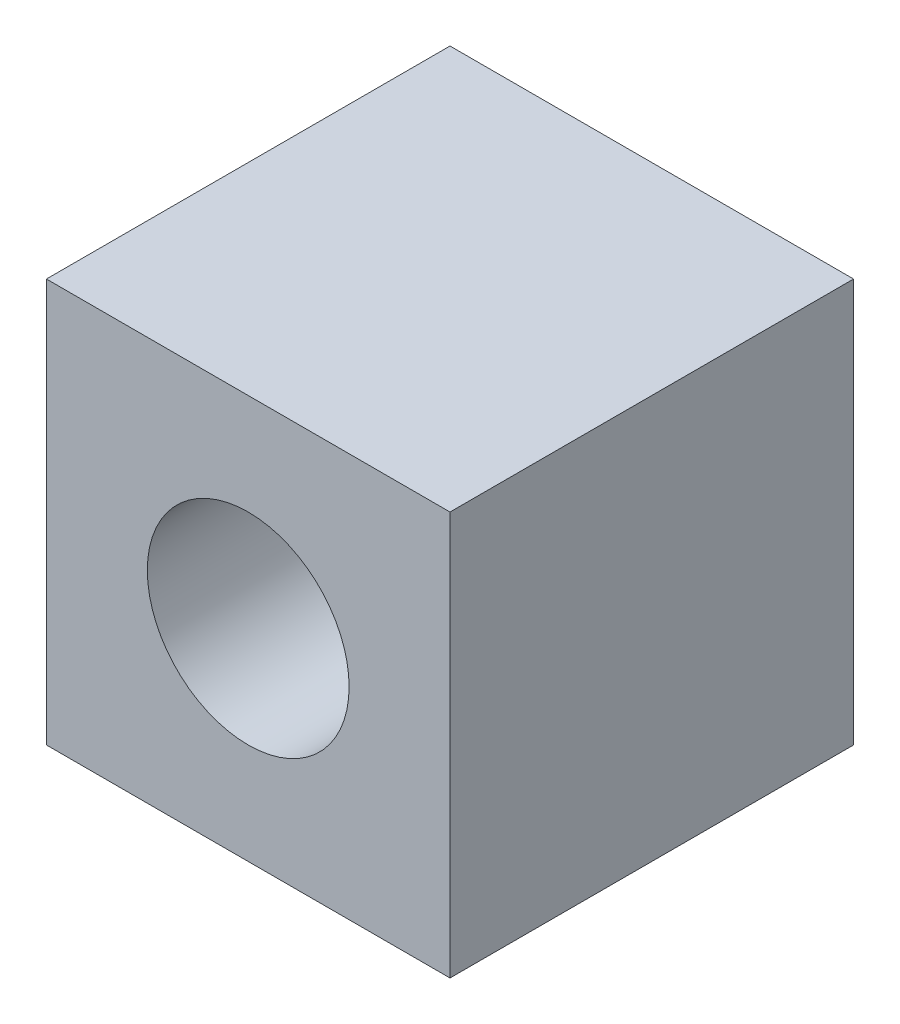
ISO-10303-21;
HEADER;
FILE_DESCRIPTION(('STEP AP214'),'2;1');
FILE_NAME('part.step','',(''),(''),'','','');
FILE_SCHEMA(('AUTOMOTIVE_DESIGN { 1 0 10303 214 1 1 1 1 }'));
ENDSEC;
DATA;
#1=APPLICATION_CONTEXT('core data for automotive mechanical design processes');
#2=APPLICATION_PROTOCOL_DEFINITION('international standard','automotive_design',2000,#1);
#3=PRODUCT_CONTEXT('',#1,'mechanical');
#4=PRODUCT('Part','Part','',(#3));
#5=PRODUCT_RELATED_PRODUCT_CATEGORY('part','',(#4));
#6=PRODUCT_DEFINITION_FORMATION('','',#4);
#7=PRODUCT_DEFINITION_CONTEXT('part definition',#1,'design');
#8=PRODUCT_DEFINITION('design','',#6,#7);
#9=PRODUCT_DEFINITION_SHAPE('','',#8);
#10=(LENGTH_UNIT() NAMED_UNIT(*) SI_UNIT(.MILLI.,.METRE.));
#11=(NAMED_UNIT(*) PLANE_ANGLE_UNIT() SI_UNIT($,.RADIAN.));
#12=(NAMED_UNIT(*) SI_UNIT($,.STERADIAN.) SOLID_ANGLE_UNIT());
#13=UNCERTAINTY_MEASURE_WITH_UNIT(LENGTH_MEASURE(1.E-05),#10,'distance_accuracy_value','');
#14=(GEOMETRIC_REPRESENTATION_CONTEXT(3) GLOBAL_UNCERTAINTY_ASSIGNED_CONTEXT((#13)) GLOBAL_UNIT_ASSIGNED_CONTEXT((#10,
#11,#12)) REPRESENTATION_CONTEXT('',''));
#15=CARTESIAN_POINT('',(0.,0.,0.));
#16=DIRECTION('',(0.,0.,1.));
#17=DIRECTION('',(1.,0.,0.));
#18=AXIS2_PLACEMENT_3D('',#15,#16,#17);
#19=CARTESIAN_POINT('',(0.,0.,10.));
#20=DIRECTION('',(0.,0.,-1.));
#21=DIRECTION('',(-1.,0.,0.));
#22=AXIS2_PLACEMENT_3D('',#19,#20,#21);
#23=PLANE('',#22);
#24=DIRECTION('',(0.,1.,0.));
#25=VECTOR('',#24,1.);
#26=CARTESIAN_POINT('',(5.,-5.,10.));
#27=LINE('',#26,#25);
#28=CARTESIAN_POINT('',(5.,-5.,10.));
#29=VERTEX_POINT('',#28);
#30=CARTESIAN_POINT('',(5.,5.,10.));
#31=VERTEX_POINT('',#30);
#32=EDGE_CURVE('E84',#29,#31,#27,.T.);
#33=ORIENTED_EDGE('',*,*,#32,.T.);
#34=DIRECTION('',(-1.,0.,0.));
#35=VECTOR('',#34,1.);
#36=CARTESIAN_POINT('',(-5.,5.,10.));
#37=LINE('',#36,#35);
#38=CARTESIAN_POINT('',(-5.,5.,10.));
#39=VERTEX_POINT('',#38);
#40=EDGE_CURVE('E79',#31,#39,#37,.T.);
#41=ORIENTED_EDGE('',*,*,#40,.T.);
#42=DIRECTION('',(0.,-1.,0.));
#43=VECTOR('',#42,1.);
#44=CARTESIAN_POINT('',(-5.,-5.,10.));
#45=LINE('',#44,#43);
#46=CARTESIAN_POINT('',(-5.,-5.,10.));
#47=VERTEX_POINT('',#46);
#48=EDGE_CURVE('E82',#39,#47,#45,.T.);
#49=ORIENTED_EDGE('',*,*,#48,.T.);
#50=DIRECTION('',(1.,0.,0.));
#51=VECTOR('',#50,1.);
#52=CARTESIAN_POINT('',(-5.,-5.,10.));
#53=LINE('',#52,#51);
#54=EDGE_CURVE('E49',#47,#29,#53,.T.);
#55=ORIENTED_EDGE('',*,*,#54,.T.);
#56=EDGE_LOOP('',(#33,#41,#49,#55));
#57=FACE_BOUND('',#56,.T.);
#58=CARTESIAN_POINT('',(0.,0.,10.));
#59=DIRECTION('',(0.,0.,1.));
#60=DIRECTION('',(1.,0.,0.));
#61=AXIS2_PLACEMENT_3D('',#58,#59,#60);
#62=CIRCLE('',#61,2.5);
#63=CARTESIAN_POINT('',(2.5,0.,10.));
#64=VERTEX_POINT('',#63);
#65=EDGE_CURVE('E99',#64,#64,#62,.T.);
#66=ORIENTED_EDGE('',*,*,#65,.F.);
#67=EDGE_LOOP('',(#66));
#68=FACE_BOUND('',#67,.T.);
#69=ADVANCED_FACE('F32',(#57,#68),#23,.F.);
#70=CARTESIAN_POINT('',(0.,0.,0.));
#71=DIRECTION('',(0.,0.,-1.));
#72=DIRECTION('',(-1.,0.,0.));
#73=AXIS2_PLACEMENT_3D('',#70,#71,#72);
#74=PLANE('',#73);
#75=DIRECTION('',(0.,1.,0.));
#76=VECTOR('',#75,1.);
#77=CARTESIAN_POINT('',(5.,-5.,0.));
#78=LINE('',#77,#76);
#79=CARTESIAN_POINT('',(5.,-5.,0.));
#80=VERTEX_POINT('',#79);
#81=CARTESIAN_POINT('',(5.,5.,0.));
#82=VERTEX_POINT('',#81);
#83=EDGE_CURVE('E96',#80,#82,#78,.T.);
#84=ORIENTED_EDGE('',*,*,#83,.F.);
#85=DIRECTION('',(1.,0.,0.));
#86=VECTOR('',#85,1.);
#87=CARTESIAN_POINT('',(-5.,-5.,0.));
#88=LINE('',#87,#86);
#89=CARTESIAN_POINT('',(-5.,-5.,0.));
#90=VERTEX_POINT('',#89);
#91=EDGE_CURVE('E72',#90,#80,#88,.T.);
#92=ORIENTED_EDGE('',*,*,#91,.F.);
#93=DIRECTION('',(0.,-1.,0.));
#94=VECTOR('',#93,1.);
#95=CARTESIAN_POINT('',(-5.,-5.,0.));
#96=LINE('',#95,#94);
#97=CARTESIAN_POINT('',(-5.,5.,0.));
#98=VERTEX_POINT('',#97);
#99=EDGE_CURVE('E66',#98,#90,#96,.T.);
#100=ORIENTED_EDGE('',*,*,#99,.F.);
#101=DIRECTION('',(-1.,0.,0.));
#102=VECTOR('',#101,1.);
#103=CARTESIAN_POINT('',(-5.,5.,0.));
#104=LINE('',#103,#102);
#105=EDGE_CURVE('E88',#82,#98,#104,.T.);
#106=ORIENTED_EDGE('',*,*,#105,.F.);
#107=EDGE_LOOP('',(#84,#92,#100,#106));
#108=FACE_BOUND('',#107,.T.);
#109=CARTESIAN_POINT('',(0.,0.,0.));
#110=DIRECTION('',(0.,0.,1.));
#111=DIRECTION('',(1.,0.,0.));
#112=AXIS2_PLACEMENT_3D('',#109,#110,#111);
#113=CIRCLE('',#112,2.5);
#114=CARTESIAN_POINT('',(2.5,0.,0.));
#115=VERTEX_POINT('',#114);
#116=EDGE_CURVE('E111',#115,#115,#113,.T.);
#117=ORIENTED_EDGE('',*,*,#116,.T.);
#118=EDGE_LOOP('',(#117));
#119=FACE_BOUND('',#118,.T.);
#120=ADVANCED_FACE('F107',(#108,#119),#74,.T.);
#121=CARTESIAN_POINT('',(5.,-5.,10.));
#122=DIRECTION('',(-1.,0.,0.));
#123=DIRECTION('',(0.,0.,1.));
#124=AXIS2_PLACEMENT_3D('',#121,#122,#123);
#125=PLANE('',#124);
#126=ORIENTED_EDGE('',*,*,#83,.T.);
#127=DIRECTION('',(0.,0.,-1.));
#128=VECTOR('',#127,1.);
#129=CARTESIAN_POINT('',(5.,5.,10.));
#130=LINE('',#129,#128);
#131=EDGE_CURVE('E11',#31,#82,#130,.T.);
#132=ORIENTED_EDGE('',*,*,#131,.F.);
#133=ORIENTED_EDGE('',*,*,#32,.F.);
#134=DIRECTION('',(0.,0.,-1.));
#135=VECTOR('',#134,1.);
#136=CARTESIAN_POINT('',(5.,-5.,10.));
#137=LINE('',#136,#135);
#138=EDGE_CURVE('E92',#29,#80,#137,.T.);
#139=ORIENTED_EDGE('',*,*,#138,.T.);
#140=EDGE_LOOP('',(#126,#132,#133,#139));
#141=FACE_BOUND('',#140,.T.);
#142=ADVANCED_FACE('F34',(#141),#125,.F.);
#143=CARTESIAN_POINT('',(-5.,5.,10.));
#144=DIRECTION('',(0.,-1.,0.));
#145=DIRECTION('',(0.,0.,-1.));
#146=AXIS2_PLACEMENT_3D('',#143,#144,#145);
#147=PLANE('',#146);
#148=ORIENTED_EDGE('',*,*,#105,.T.);
#149=DIRECTION('',(0.,0.,-1.));
#150=VECTOR('',#149,1.);
#151=CARTESIAN_POINT('',(-5.,5.,10.));
#152=LINE('',#151,#150);
#153=EDGE_CURVE('E41',#39,#98,#152,.T.);
#154=ORIENTED_EDGE('',*,*,#153,.F.);
#155=ORIENTED_EDGE('',*,*,#40,.F.);
#156=ORIENTED_EDGE('',*,*,#131,.T.);
#157=EDGE_LOOP('',(#148,#154,#155,#156));
#158=FACE_BOUND('',#157,.T.);
#159=ADVANCED_FACE('F87',(#158),#147,.F.);
#160=CARTESIAN_POINT('',(-5.,-5.,10.));
#161=DIRECTION('',(1.,0.,0.));
#162=DIRECTION('',(0.,0.,-1.));
#163=AXIS2_PLACEMENT_3D('',#160,#161,#162);
#164=PLANE('',#163);
#165=ORIENTED_EDGE('',*,*,#99,.T.);
#166=DIRECTION('',(0.,0.,-1.));
#167=VECTOR('',#166,1.);
#168=CARTESIAN_POINT('',(-5.,-5.,10.));
#169=LINE('',#168,#167);
#170=EDGE_CURVE('E89',#47,#90,#169,.T.);
#171=ORIENTED_EDGE('',*,*,#170,.F.);
#172=ORIENTED_EDGE('',*,*,#48,.F.);
#173=ORIENTED_EDGE('',*,*,#153,.T.);
#174=EDGE_LOOP('',(#165,#171,#172,#173));
#175=FACE_BOUND('',#174,.T.);
#176=ADVANCED_FACE('F90',(#175),#164,.F.);
#177=CARTESIAN_POINT('',(-5.,-5.,10.));
#178=DIRECTION('',(0.,1.,0.));
#179=DIRECTION('',(0.,0.,1.));
#180=AXIS2_PLACEMENT_3D('',#177,#178,#179);
#181=PLANE('',#180);
#182=ORIENTED_EDGE('',*,*,#91,.T.);
#183=ORIENTED_EDGE('',*,*,#138,.F.);
#184=ORIENTED_EDGE('',*,*,#54,.F.);
#185=ORIENTED_EDGE('',*,*,#170,.T.);
#186=EDGE_LOOP('',(#182,#183,#184,#185));
#187=FACE_BOUND('',#186,.T.);
#188=ADVANCED_FACE('F104',(#187),#181,.F.);
#189=CARTESIAN_POINT('',(0.,0.,10.));
#190=DIRECTION('',(0.,0.,-1.));
#191=DIRECTION('',(-1.,0.,0.));
#192=AXIS2_PLACEMENT_3D('',#189,#190,#191);
#193=CYLINDRICAL_SURFACE('',#192,2.5);
#194=ORIENTED_EDGE('',*,*,#65,.T.);
#195=EDGE_LOOP('',(#194));
#196=FACE_BOUND('',#195,.T.);
#197=ORIENTED_EDGE('',*,*,#116,.F.);
#198=EDGE_LOOP('',(#197));
#199=FACE_BOUND('',#198,.T.);
#200=ADVANCED_FACE('F117',(#196,#199),#193,.F.);
#201=CLOSED_SHELL('',(#69,#120,#142,#159,#176,#188,#200));
#202=MANIFOLD_SOLID_BREP('B2',#201);
#203=ADVANCED_BREP_SHAPE_REPRESENTATION('',(#18,#202),#14);
#204=SHAPE_DEFINITION_REPRESENTATION(#9,#203);
ENDSEC;
END-ISO-10303-21;
